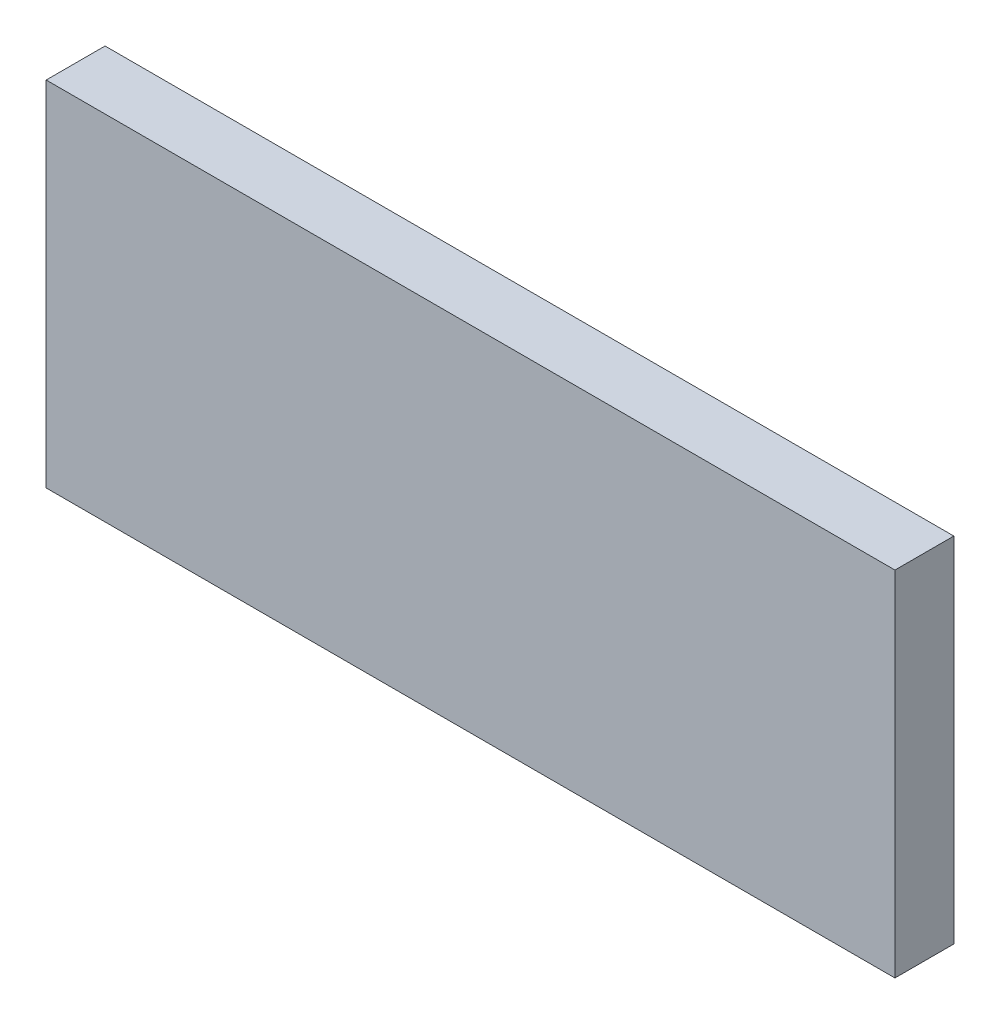
ISO-10303-21;
HEADER;
FILE_DESCRIPTION(('STEP AP214'),'2;1');
FILE_NAME('part.step','',(''),(''),'','','');
FILE_SCHEMA(('AUTOMOTIVE_DESIGN { 1 0 10303 214 1 1 1 1 }'));
ENDSEC;
DATA;
#1=APPLICATION_CONTEXT('core data for automotive mechanical design processes');
#2=APPLICATION_PROTOCOL_DEFINITION('international standard','automotive_design',2000,#1);
#3=PRODUCT_CONTEXT('',#1,'mechanical');
#4=PRODUCT('Part','Part','',(#3));
#5=PRODUCT_RELATED_PRODUCT_CATEGORY('part','',(#4));
#6=PRODUCT_DEFINITION_FORMATION('','',#4);
#7=PRODUCT_DEFINITION_CONTEXT('part definition',#1,'design');
#8=PRODUCT_DEFINITION('design','',#6,#7);
#9=PRODUCT_DEFINITION_SHAPE('','',#8);
#10=(LENGTH_UNIT() NAMED_UNIT(*) SI_UNIT(.MILLI.,.METRE.));
#11=(NAMED_UNIT(*) PLANE_ANGLE_UNIT() SI_UNIT($,.RADIAN.));
#12=(NAMED_UNIT(*) SI_UNIT($,.STERADIAN.) SOLID_ANGLE_UNIT());
#13=UNCERTAINTY_MEASURE_WITH_UNIT(LENGTH_MEASURE(1.E-05),#10,'distance_accuracy_value','');
#14=(GEOMETRIC_REPRESENTATION_CONTEXT(3) GLOBAL_UNCERTAINTY_ASSIGNED_CONTEXT((#13)) GLOBAL_UNIT_ASSIGNED_CONTEXT((#10,
#11,#12)) REPRESENTATION_CONTEXT('',''));
#15=CARTESIAN_POINT('',(0.,0.,0.));
#16=DIRECTION('',(0.,0.,1.));
#17=DIRECTION('',(1.,0.,0.));
#18=AXIS2_PLACEMENT_3D('',#15,#16,#17);
#19=CARTESIAN_POINT('',(36.035,30.,2.5));
#20=DIRECTION('',(-1.,0.,0.));
#21=DIRECTION('',(0.,0.,1.));
#22=AXIS2_PLACEMENT_3D('',#19,#20,#21);
#23=PLANE('',#22);
#24=DIRECTION('',(0.,0.,-1.));
#25=VECTOR('',#24,1.);
#26=CARTESIAN_POINT('',(36.035,0.,2.5));
#27=LINE('',#26,#25);
#28=CARTESIAN_POINT('',(36.035,0.,2.5));
#29=VERTEX_POINT('',#28);
#30=CARTESIAN_POINT('',(36.035,0.,-2.5));
#31=VERTEX_POINT('',#30);
#32=EDGE_CURVE('E214',#29,#31,#27,.T.);
#33=ORIENTED_EDGE('',*,*,#32,.T.);
#34=DIRECTION('',(0.,-1.,0.));
#35=VECTOR('',#34,1.);
#36=CARTESIAN_POINT('',(36.035,30.,-2.5));
#37=LINE('',#36,#35);
#38=CARTESIAN_POINT('',(36.035,30.,-2.5));
#39=VERTEX_POINT('',#38);
#40=EDGE_CURVE('E11',#39,#31,#37,.T.);
#41=ORIENTED_EDGE('',*,*,#40,.F.);
#42=DIRECTION('',(0.,0.,-1.));
#43=VECTOR('',#42,1.);
#44=CARTESIAN_POINT('',(36.035,30.,2.5));
#45=LINE('',#44,#43);
#46=CARTESIAN_POINT('',(36.035,30.,2.5));
#47=VERTEX_POINT('',#46);
#48=EDGE_CURVE('E229',#47,#39,#45,.T.);
#49=ORIENTED_EDGE('',*,*,#48,.F.);
#50=DIRECTION('',(0.,-1.,0.));
#51=VECTOR('',#50,1.);
#52=CARTESIAN_POINT('',(36.035,30.,2.5));
#53=LINE('',#52,#51);
#54=EDGE_CURVE('E239',#47,#29,#53,.T.);
#55=ORIENTED_EDGE('',*,*,#54,.T.);
#56=EDGE_LOOP('',(#33,#41,#49,#55));
#57=FACE_BOUND('',#56,.T.);
#58=ADVANCED_FACE('F35',(#57),#23,.F.);
#59=CARTESIAN_POINT('',(-36.035,30.,-2.5));
#60=DIRECTION('',(0.,0.,1.));
#61=DIRECTION('',(1.,0.,0.));
#62=AXIS2_PLACEMENT_3D('',#59,#60,#61);
#63=PLANE('',#62);
#64=DIRECTION('',(0.,1.,0.));
#65=VECTOR('',#64,1.);
#66=CARTESIAN_POINT('',(27.2450653599425,4.75,-2.5));
#67=LINE('',#66,#65);
#68=CARTESIAN_POINT('',(27.2450653599425,4.75,-2.5));
#69=VERTEX_POINT('',#68);
#70=CARTESIAN_POINT('',(27.2450653599425,25.25,-2.5));
#71=VERTEX_POINT('',#70);
#72=EDGE_CURVE('E147',#69,#71,#67,.T.);
#73=ORIENTED_EDGE('',*,*,#72,.F.);
#74=DIRECTION('',(-1.,0.,0.));
#75=VECTOR('',#74,1.);
#76=CARTESIAN_POINT('',(27.2450653599425,4.75,-2.5));
#77=LINE('',#76,#75);
#78=CARTESIAN_POINT('',(33.3649782133525,4.75,-2.5));
#79=VERTEX_POINT('',#78);
#80=EDGE_CURVE('E154',#79,#69,#77,.T.);
#81=ORIENTED_EDGE('',*,*,#80,.F.);
#82=DIRECTION('',(0.,1.,0.));
#83=VECTOR('',#82,1.);
#84=CARTESIAN_POINT('',(33.3649782133525,4.75,-2.5));
#85=LINE('',#84,#83);
#86=CARTESIAN_POINT('',(33.3649782133525,25.25,-2.5));
#87=VERTEX_POINT('',#86);
#88=EDGE_CURVE('E166',#79,#87,#85,.T.);
#89=ORIENTED_EDGE('',*,*,#88,.T.);
#90=DIRECTION('',(-1.,0.,0.));
#91=VECTOR('',#90,1.);
#92=CARTESIAN_POINT('',(27.2450653599425,25.25,-2.5));
#93=LINE('',#92,#91);
#94=EDGE_CURVE('E164',#87,#71,#93,.T.);
#95=ORIENTED_EDGE('',*,*,#94,.T.);
#96=EDGE_LOOP('',(#73,#81,#89,#95));
#97=FACE_BOUND('',#96,.T.);
#98=DIRECTION('',(0.,1.,0.));
#99=VECTOR('',#98,1.);
#100=CARTESIAN_POINT('',(-31.035,20.25,-2.5));
#101=LINE('',#100,#99);
#102=CARTESIAN_POINT('',(-31.035,19.,-2.5));
#103=VERTEX_POINT('',#102);
#104=CARTESIAN_POINT('',(-31.035,20.25,-2.5));
#105=VERTEX_POINT('',#104);
#106=EDGE_CURVE('E196',#103,#105,#101,.T.);
#107=ORIENTED_EDGE('',*,*,#106,.F.);
#108=DIRECTION('',(1.,0.,0.));
#109=VECTOR('',#108,1.);
#110=CARTESIAN_POINT('',(-31.035,19.,-2.5));
#111=LINE('',#110,#109);
#112=CARTESIAN_POINT('',(-36.035,19.,-2.5));
#113=VERTEX_POINT('',#112);
#114=EDGE_CURVE('E193',#113,#103,#111,.T.);
#115=ORIENTED_EDGE('',*,*,#114,.F.);
#116=DIRECTION('',(0.,-1.,0.));
#117=VECTOR('',#116,1.);
#118=CARTESIAN_POINT('',(-36.035,30.,-2.5));
#119=LINE('',#118,#117);
#120=CARTESIAN_POINT('',(-36.035,30.,-2.5));
#121=VERTEX_POINT('',#120);
#122=EDGE_CURVE('E42',#121,#113,#119,.T.);
#123=ORIENTED_EDGE('',*,*,#122,.F.);
#124=DIRECTION('',(-1.,0.,0.));
#125=VECTOR('',#124,1.);
#126=CARTESIAN_POINT('',(-36.035,30.,-2.5));
#127=LINE('',#126,#125);
#128=EDGE_CURVE('E232',#39,#121,#127,.T.);
#129=ORIENTED_EDGE('',*,*,#128,.F.);
#130=ORIENTED_EDGE('',*,*,#40,.T.);
#131=DIRECTION('',(-1.,0.,0.));
#132=VECTOR('',#131,1.);
#133=CARTESIAN_POINT('',(-36.035,0.,-2.5));
#134=LINE('',#133,#132);
#135=CARTESIAN_POINT('',(-36.035,0.,-2.5));
#136=VERTEX_POINT('',#135);
#137=EDGE_CURVE('E242',#31,#136,#134,.T.);
#138=ORIENTED_EDGE('',*,*,#137,.T.);
#139=CARTESIAN_POINT('',(-36.035,11.,-2.5));
#140=VERTEX_POINT('',#139);
#141=EDGE_CURVE('E252',#140,#136,#119,.T.);
#142=ORIENTED_EDGE('',*,*,#141,.F.);
#143=DIRECTION('',(-1.,0.,0.));
#144=VECTOR('',#143,1.);
#145=CARTESIAN_POINT('',(-36.035,11.,-2.5));
#146=LINE('',#145,#144);
#147=CARTESIAN_POINT('',(-31.035,11.,-2.5));
#148=VERTEX_POINT('',#147);
#149=EDGE_CURVE('E175',#148,#140,#146,.T.);
#150=ORIENTED_EDGE('',*,*,#149,.F.);
#151=DIRECTION('',(0.,1.,0.));
#152=VECTOR('',#151,1.);
#153=CARTESIAN_POINT('',(-31.035,11.,-2.5));
#154=LINE('',#153,#152);
#155=CARTESIAN_POINT('',(-31.035,9.75,-2.5));
#156=VERTEX_POINT('',#155);
#157=EDGE_CURVE('E208',#156,#148,#154,.T.);
#158=ORIENTED_EDGE('',*,*,#157,.F.);
#159=DIRECTION('',(-1.,0.,0.));
#160=VECTOR('',#159,1.);
#161=CARTESIAN_POINT('',(-31.035,9.75,-2.5));
#162=LINE('',#161,#160);
#163=CARTESIAN_POINT('',(1.465,9.75,-2.5));
#164=VERTEX_POINT('',#163);
#165=EDGE_CURVE('E205',#164,#156,#162,.T.);
#166=ORIENTED_EDGE('',*,*,#165,.F.);
#167=DIRECTION('',(0.,-1.,0.));
#168=VECTOR('',#167,1.);
#169=CARTESIAN_POINT('',(1.465,9.75,-2.5));
#170=LINE('',#169,#168);
#171=CARTESIAN_POINT('',(1.465,20.25,-2.5));
#172=VERTEX_POINT('',#171);
#173=EDGE_CURVE('E202',#172,#164,#170,.T.);
#174=ORIENTED_EDGE('',*,*,#173,.F.);
#175=DIRECTION('',(1.,0.,0.));
#176=VECTOR('',#175,1.);
#177=CARTESIAN_POINT('',(1.465,20.25,-2.5));
#178=LINE('',#177,#176);
#179=EDGE_CURVE('E199',#105,#172,#178,.T.);
#180=ORIENTED_EDGE('',*,*,#179,.F.);
#181=EDGE_LOOP('',(#107,#115,#123,#129,#130,#138,#142,#150,#158,#166,#174,#180));
#182=FACE_BOUND('',#181,.T.);
#183=ADVANCED_FACE('F162',(#97,#182),#63,.F.);
#184=CARTESIAN_POINT('',(-36.035,30.,2.5));
#185=DIRECTION('',(1.,0.,0.));
#186=DIRECTION('',(0.,0.,-1.));
#187=AXIS2_PLACEMENT_3D('',#184,#185,#186);
#188=PLANE('',#187);
#189=ORIENTED_EDGE('',*,*,#122,.T.);
#190=DIRECTION('',(0.,0.,-1.));
#191=VECTOR('',#190,1.);
#192=CARTESIAN_POINT('',(-36.035,19.,1.5));
#193=LINE('',#192,#191);
#194=CARTESIAN_POINT('',(-36.035,19.,1.5));
#195=VERTEX_POINT('',#194);
#196=EDGE_CURVE('E212',#195,#113,#193,.T.);
#197=ORIENTED_EDGE('',*,*,#196,.F.);
#198=DIRECTION('',(0.,1.,0.));
#199=VECTOR('',#198,1.);
#200=CARTESIAN_POINT('',(-36.035,19.,1.5));
#201=LINE('',#200,#199);
#202=CARTESIAN_POINT('',(-36.035,11.,1.5));
#203=VERTEX_POINT('',#202);
#204=EDGE_CURVE('E190',#203,#195,#201,.T.);
#205=ORIENTED_EDGE('',*,*,#204,.F.);
#206=DIRECTION('',(0.,0.,-1.));
#207=VECTOR('',#206,1.);
#208=CARTESIAN_POINT('',(-36.035,11.,1.5));
#209=LINE('',#208,#207);
#210=EDGE_CURVE('E215',#203,#140,#209,.T.);
#211=ORIENTED_EDGE('',*,*,#210,.T.);
#212=ORIENTED_EDGE('',*,*,#141,.T.);
#213=DIRECTION('',(0.,0.,1.));
#214=VECTOR('',#213,1.);
#215=CARTESIAN_POINT('',(-36.035,0.,2.5));
#216=LINE('',#215,#214);
#217=CARTESIAN_POINT('',(-36.035,0.,2.5));
#218=VERTEX_POINT('',#217);
#219=EDGE_CURVE('E245',#136,#218,#216,.T.);
#220=ORIENTED_EDGE('',*,*,#219,.T.);
#221=DIRECTION('',(0.,-1.,0.));
#222=VECTOR('',#221,1.);
#223=CARTESIAN_POINT('',(-36.035,30.,2.5));
#224=LINE('',#223,#222);
#225=CARTESIAN_POINT('',(-36.035,30.,2.5));
#226=VERTEX_POINT('',#225);
#227=EDGE_CURVE('E250',#226,#218,#224,.T.);
#228=ORIENTED_EDGE('',*,*,#227,.F.);
#229=DIRECTION('',(0.,0.,1.));
#230=VECTOR('',#229,1.);
#231=CARTESIAN_POINT('',(-36.035,30.,2.5));
#232=LINE('',#231,#230);
#233=EDGE_CURVE('E235',#121,#226,#232,.T.);
#234=ORIENTED_EDGE('',*,*,#233,.F.);
#235=EDGE_LOOP('',(#189,#197,#205,#211,#212,#220,#228,#234));
#236=FACE_BOUND('',#235,.T.);
#237=ADVANCED_FACE('F259',(#236),#188,.F.);
#238=CARTESIAN_POINT('',(-36.035,30.,2.5));
#239=DIRECTION('',(0.,0.,-1.));
#240=DIRECTION('',(-1.,0.,0.));
#241=AXIS2_PLACEMENT_3D('',#238,#239,#240);
#242=PLANE('',#241);
#243=DIRECTION('',(1.,0.,0.));
#244=VECTOR('',#243,1.);
#245=CARTESIAN_POINT('',(-36.035,0.,2.5));
#246=LINE('',#245,#244);
#247=EDGE_CURVE('E233',#218,#29,#246,.T.);
#248=ORIENTED_EDGE('',*,*,#247,.T.);
#249=ORIENTED_EDGE('',*,*,#54,.F.);
#250=DIRECTION('',(1.,0.,0.));
#251=VECTOR('',#250,1.);
#252=CARTESIAN_POINT('',(-36.035,30.,2.5));
#253=LINE('',#252,#251);
#254=EDGE_CURVE('E237',#226,#47,#253,.T.);
#255=ORIENTED_EDGE('',*,*,#254,.F.);
#256=ORIENTED_EDGE('',*,*,#227,.T.);
#257=EDGE_LOOP('',(#248,#249,#255,#256));
#258=FACE_BOUND('',#257,.T.);
#259=ADVANCED_FACE('F272',(#258),#242,.F.);
#260=CARTESIAN_POINT('',(0.,30.,0.));
#261=DIRECTION('',(0.,-1.,0.));
#262=DIRECTION('',(0.,0.,-1.));
#263=AXIS2_PLACEMENT_3D('',#260,#261,#262);
#264=PLANE('',#263);
#265=ORIENTED_EDGE('',*,*,#48,.T.);
#266=ORIENTED_EDGE('',*,*,#128,.T.);
#267=ORIENTED_EDGE('',*,*,#233,.T.);
#268=ORIENTED_EDGE('',*,*,#254,.T.);
#269=EDGE_LOOP('',(#265,#266,#267,#268));
#270=FACE_BOUND('',#269,.T.);
#271=ADVANCED_FACE('F277',(#270),#264,.F.);
#272=CARTESIAN_POINT('',(0.,0.,0.));
#273=DIRECTION('',(0.,-1.,0.));
#274=DIRECTION('',(0.,0.,-1.));
#275=AXIS2_PLACEMENT_3D('',#272,#273,#274);
#276=PLANE('',#275);
#277=ORIENTED_EDGE('',*,*,#32,.F.);
#278=ORIENTED_EDGE('',*,*,#247,.F.);
#279=ORIENTED_EDGE('',*,*,#219,.F.);
#280=ORIENTED_EDGE('',*,*,#137,.F.);
#281=EDGE_LOOP('',(#277,#278,#279,#280));
#282=FACE_BOUND('',#281,.T.);
#283=ADVANCED_FACE('F269',(#282),#276,.T.);
#284=CARTESIAN_POINT('',(-31.035,19.,1.5));
#285=DIRECTION('',(0.,1.,0.));
#286=DIRECTION('',(0.,0.,1.));
#287=AXIS2_PLACEMENT_3D('',#284,#285,#286);
#288=PLANE('',#287);
#289=ORIENTED_EDGE('',*,*,#114,.T.);
#290=DIRECTION('',(0.,0.,-1.));
#291=VECTOR('',#290,1.);
#292=CARTESIAN_POINT('',(-31.035,19.,1.5));
#293=LINE('',#292,#291);
#294=CARTESIAN_POINT('',(-31.035,19.,1.5));
#295=VERTEX_POINT('',#294);
#296=EDGE_CURVE('E192',#295,#103,#293,.T.);
#297=ORIENTED_EDGE('',*,*,#296,.F.);
#298=DIRECTION('',(1.,0.,0.));
#299=VECTOR('',#298,1.);
#300=CARTESIAN_POINT('',(-31.035,19.,1.5));
#301=LINE('',#300,#299);
#302=EDGE_CURVE('E171',#195,#295,#301,.T.);
#303=ORIENTED_EDGE('',*,*,#302,.F.);
#304=ORIENTED_EDGE('',*,*,#196,.T.);
#305=EDGE_LOOP('',(#289,#297,#303,#304));
#306=FACE_BOUND('',#305,.T.);
#307=ADVANCED_FACE('F281',(#306),#288,.F.);
#308=CARTESIAN_POINT('',(-36.035,11.,1.5));
#309=DIRECTION('',(0.,-1.,0.));
#310=DIRECTION('',(0.,0.,-1.));
#311=AXIS2_PLACEMENT_3D('',#308,#309,#310);
#312=PLANE('',#311);
#313=ORIENTED_EDGE('',*,*,#149,.T.);
#314=ORIENTED_EDGE('',*,*,#210,.F.);
#315=DIRECTION('',(-1.,0.,0.));
#316=VECTOR('',#315,1.);
#317=CARTESIAN_POINT('',(-36.035,11.,1.5));
#318=LINE('',#317,#316);
#319=CARTESIAN_POINT('',(-31.035,11.,1.5));
#320=VERTEX_POINT('',#319);
#321=EDGE_CURVE('E57',#320,#203,#318,.T.);
#322=ORIENTED_EDGE('',*,*,#321,.F.);
#323=DIRECTION('',(0.,0.,-1.));
#324=VECTOR('',#323,1.);
#325=CARTESIAN_POINT('',(-31.035,11.,1.5));
#326=LINE('',#325,#324);
#327=EDGE_CURVE('E218',#320,#148,#326,.T.);
#328=ORIENTED_EDGE('',*,*,#327,.T.);
#329=EDGE_LOOP('',(#313,#314,#322,#328));
#330=FACE_BOUND('',#329,.T.);
#331=ADVANCED_FACE('F302',(#330),#312,.F.);
#332=CARTESIAN_POINT('',(-31.035,11.,1.5));
#333=DIRECTION('',(-1.,0.,0.));
#334=DIRECTION('',(0.,0.,1.));
#335=AXIS2_PLACEMENT_3D('',#332,#333,#334);
#336=PLANE('',#335);
#337=ORIENTED_EDGE('',*,*,#157,.T.);
#338=ORIENTED_EDGE('',*,*,#327,.F.);
#339=DIRECTION('',(0.,1.,0.));
#340=VECTOR('',#339,1.);
#341=CARTESIAN_POINT('',(-31.035,11.,1.5));
#342=LINE('',#341,#340);
#343=CARTESIAN_POINT('',(-31.035,9.75,1.5));
#344=VERTEX_POINT('',#343);
#345=EDGE_CURVE('E187',#344,#320,#342,.T.);
#346=ORIENTED_EDGE('',*,*,#345,.F.);
#347=DIRECTION('',(0.,0.,-1.));
#348=VECTOR('',#347,1.);
#349=CARTESIAN_POINT('',(-31.035,9.75,1.5));
#350=LINE('',#349,#348);
#351=EDGE_CURVE('E220',#344,#156,#350,.T.);
#352=ORIENTED_EDGE('',*,*,#351,.T.);
#353=EDGE_LOOP('',(#337,#338,#346,#352));
#354=FACE_BOUND('',#353,.T.);
#355=ADVANCED_FACE('F300',(#354),#336,.F.);
#356=CARTESIAN_POINT('',(-31.035,9.75,1.5));
#357=DIRECTION('',(0.,-1.,0.));
#358=DIRECTION('',(0.,0.,-1.));
#359=AXIS2_PLACEMENT_3D('',#356,#357,#358);
#360=PLANE('',#359);
#361=ORIENTED_EDGE('',*,*,#165,.T.);
#362=ORIENTED_EDGE('',*,*,#351,.F.);
#363=DIRECTION('',(-1.,0.,0.));
#364=VECTOR('',#363,1.);
#365=CARTESIAN_POINT('',(-31.035,9.75,1.5));
#366=LINE('',#365,#364);
#367=CARTESIAN_POINT('',(1.465,9.75,1.5));
#368=VERTEX_POINT('',#367);
#369=EDGE_CURVE('E184',#368,#344,#366,.T.);
#370=ORIENTED_EDGE('',*,*,#369,.F.);
#371=DIRECTION('',(0.,0.,-1.));
#372=VECTOR('',#371,1.);
#373=CARTESIAN_POINT('',(1.465,9.75,1.5));
#374=LINE('',#373,#372);
#375=EDGE_CURVE('E222',#368,#164,#374,.T.);
#376=ORIENTED_EDGE('',*,*,#375,.T.);
#377=EDGE_LOOP('',(#361,#362,#370,#376));
#378=FACE_BOUND('',#377,.T.);
#379=ADVANCED_FACE('F296',(#378),#360,.F.);
#380=CARTESIAN_POINT('',(1.465,9.75,1.5));
#381=DIRECTION('',(1.,0.,0.));
#382=DIRECTION('',(0.,0.,-1.));
#383=AXIS2_PLACEMENT_3D('',#380,#381,#382);
#384=PLANE('',#383);
#385=ORIENTED_EDGE('',*,*,#173,.T.);
#386=ORIENTED_EDGE('',*,*,#375,.F.);
#387=DIRECTION('',(0.,-1.,0.));
#388=VECTOR('',#387,1.);
#389=CARTESIAN_POINT('',(1.465,9.75,1.5));
#390=LINE('',#389,#388);
#391=CARTESIAN_POINT('',(1.465,20.25,1.5));
#392=VERTEX_POINT('',#391);
#393=EDGE_CURVE('E181',#392,#368,#390,.T.);
#394=ORIENTED_EDGE('',*,*,#393,.F.);
#395=DIRECTION('',(0.,0.,-1.));
#396=VECTOR('',#395,1.);
#397=CARTESIAN_POINT('',(1.465,20.25,1.5));
#398=LINE('',#397,#396);
#399=EDGE_CURVE('E224',#392,#172,#398,.T.);
#400=ORIENTED_EDGE('',*,*,#399,.T.);
#401=EDGE_LOOP('',(#385,#386,#394,#400));
#402=FACE_BOUND('',#401,.T.);
#403=ADVANCED_FACE('F292',(#402),#384,.F.);
#404=CARTESIAN_POINT('',(1.465,20.25,1.5));
#405=DIRECTION('',(0.,1.,0.));
#406=DIRECTION('',(0.,0.,1.));
#407=AXIS2_PLACEMENT_3D('',#404,#405,#406);
#408=PLANE('',#407);
#409=ORIENTED_EDGE('',*,*,#179,.T.);
#410=ORIENTED_EDGE('',*,*,#399,.F.);
#411=DIRECTION('',(1.,0.,0.));
#412=VECTOR('',#411,1.);
#413=CARTESIAN_POINT('',(1.465,20.25,1.5));
#414=LINE('',#413,#412);
#415=CARTESIAN_POINT('',(-31.035,20.25,1.5));
#416=VERTEX_POINT('',#415);
#417=EDGE_CURVE('E178',#416,#392,#414,.T.);
#418=ORIENTED_EDGE('',*,*,#417,.F.);
#419=DIRECTION('',(0.,0.,-1.));
#420=VECTOR('',#419,1.);
#421=CARTESIAN_POINT('',(-31.035,20.25,1.5));
#422=LINE('',#421,#420);
#423=EDGE_CURVE('E226',#416,#105,#422,.T.);
#424=ORIENTED_EDGE('',*,*,#423,.T.);
#425=EDGE_LOOP('',(#409,#410,#418,#424));
#426=FACE_BOUND('',#425,.T.);
#427=ADVANCED_FACE('F288',(#426),#408,.F.);
#428=CARTESIAN_POINT('',(-31.035,20.25,1.5));
#429=DIRECTION('',(-1.,0.,0.));
#430=DIRECTION('',(0.,0.,1.));
#431=AXIS2_PLACEMENT_3D('',#428,#429,#430);
#432=PLANE('',#431);
#433=ORIENTED_EDGE('',*,*,#106,.T.);
#434=ORIENTED_EDGE('',*,*,#423,.F.);
#435=DIRECTION('',(0.,1.,0.));
#436=VECTOR('',#435,1.);
#437=CARTESIAN_POINT('',(-31.035,20.25,1.5));
#438=LINE('',#437,#436);
#439=EDGE_CURVE('E174',#295,#416,#438,.T.);
#440=ORIENTED_EDGE('',*,*,#439,.F.);
#441=ORIENTED_EDGE('',*,*,#296,.T.);
#442=EDGE_LOOP('',(#433,#434,#440,#441));
#443=FACE_BOUND('',#442,.T.);
#444=ADVANCED_FACE('F286',(#443),#432,.F.);
#445=CARTESIAN_POINT('',(0.,0.,1.5));
#446=DIRECTION('',(0.,0.,1.));
#447=DIRECTION('',(1.,0.,0.));
#448=AXIS2_PLACEMENT_3D('',#445,#446,#447);
#449=PLANE('',#448);
#450=ORIENTED_EDGE('',*,*,#302,.T.);
#451=ORIENTED_EDGE('',*,*,#439,.T.);
#452=ORIENTED_EDGE('',*,*,#417,.T.);
#453=ORIENTED_EDGE('',*,*,#393,.T.);
#454=ORIENTED_EDGE('',*,*,#369,.T.);
#455=ORIENTED_EDGE('',*,*,#345,.T.);
#456=ORIENTED_EDGE('',*,*,#321,.T.);
#457=ORIENTED_EDGE('',*,*,#204,.T.);
#458=EDGE_LOOP('',(#450,#451,#452,#453,#454,#455,#456,#457));
#459=FACE_BOUND('',#458,.T.);
#460=ADVANCED_FACE('F283',(#459),#449,.F.);
#461=CARTESIAN_POINT('',(33.3649782133525,4.75,-2.5));
#462=DIRECTION('',(0.866025403784439,0.,0.499999999999999));
#463=DIRECTION('',(0.499999999999999,0.,-0.866025403784439));
#464=AXIS2_PLACEMENT_3D('',#461,#462,#463);
#465=PLANE('',#464);
#466=DIRECTION('',(0.499999999999999,0.,-0.866025403784439));
#467=VECTOR('',#466,1.);
#468=CARTESIAN_POINT('',(33.3649782133525,25.25,-2.5));
#469=LINE('',#468,#467);
#470=CARTESIAN_POINT('',(31.835,25.25,0.15));
#471=VERTEX_POINT('',#470);
#472=EDGE_CURVE('E160',#471,#87,#469,.T.);
#473=ORIENTED_EDGE('',*,*,#472,.T.);
#474=ORIENTED_EDGE('',*,*,#88,.F.);
#475=DIRECTION('',(0.499999999999999,0.,-0.866025403784439));
#476=VECTOR('',#475,1.);
#477=CARTESIAN_POINT('',(33.3649782133525,4.75,-2.5));
#478=LINE('',#477,#476);
#479=CARTESIAN_POINT('',(31.835,4.75,0.15));
#480=VERTEX_POINT('',#479);
#481=EDGE_CURVE('E153',#480,#79,#478,.T.);
#482=ORIENTED_EDGE('',*,*,#481,.F.);
#483=DIRECTION('',(0.,1.,0.));
#484=VECTOR('',#483,1.);
#485=CARTESIAN_POINT('',(31.835,4.75,0.15));
#486=LINE('',#485,#484);
#487=EDGE_CURVE('E149',#480,#471,#486,.T.);
#488=ORIENTED_EDGE('',*,*,#487,.T.);
#489=EDGE_LOOP('',(#473,#474,#482,#488));
#490=FACE_BOUND('',#489,.T.);
#491=ADVANCED_FACE('F356',(#490),#465,.F.);
#492=CARTESIAN_POINT('',(31.835,4.75,0.15));
#493=DIRECTION('',(-0.500000000000001,0.,0.866025403784438));
#494=DIRECTION('',(0.866025403784438,0.,0.500000000000001));
#495=AXIS2_PLACEMENT_3D('',#492,#493,#494);
#496=PLANE('',#495);
#497=DIRECTION('',(0.866025403784438,0.,0.500000000000001));
#498=VECTOR('',#497,1.);
#499=CARTESIAN_POINT('',(31.835,25.25,0.15));
#500=LINE('',#499,#498);
#501=EDGE_CURVE('E49',#71,#471,#500,.T.);
#502=ORIENTED_EDGE('',*,*,#501,.T.);
#503=ORIENTED_EDGE('',*,*,#487,.F.);
#504=DIRECTION('',(0.866025403784438,0.,0.500000000000001));
#505=VECTOR('',#504,1.);
#506=CARTESIAN_POINT('',(31.835,4.75,0.15));
#507=LINE('',#506,#505);
#508=EDGE_CURVE('E143',#69,#480,#507,.T.);
#509=ORIENTED_EDGE('',*,*,#508,.F.);
#510=ORIENTED_EDGE('',*,*,#72,.T.);
#511=EDGE_LOOP('',(#502,#503,#509,#510));
#512=FACE_BOUND('',#511,.T.);
#513=ADVANCED_FACE('F145',(#512),#496,.F.);
#514=CARTESIAN_POINT('',(0.,4.75,0.));
#515=DIRECTION('',(0.,-1.,0.));
#516=DIRECTION('',(0.,0.,-1.));
#517=AXIS2_PLACEMENT_3D('',#514,#515,#516);
#518=PLANE('',#517);
#519=ORIENTED_EDGE('',*,*,#80,.T.);
#520=ORIENTED_EDGE('',*,*,#508,.T.);
#521=ORIENTED_EDGE('',*,*,#481,.T.);
#522=EDGE_LOOP('',(#519,#520,#521));
#523=FACE_BOUND('',#522,.T.);
#524=ADVANCED_FACE('F157',(#523),#518,.F.);
#525=CARTESIAN_POINT('',(0.,25.25,0.));
#526=DIRECTION('',(0.,-1.,0.));
#527=DIRECTION('',(0.,0.,-1.));
#528=AXIS2_PLACEMENT_3D('',#525,#526,#527);
#529=PLANE('',#528);
#530=ORIENTED_EDGE('',*,*,#94,.F.);
#531=ORIENTED_EDGE('',*,*,#472,.F.);
#532=ORIENTED_EDGE('',*,*,#501,.F.);
#533=EDGE_LOOP('',(#530,#531,#532));
#534=FACE_BOUND('',#533,.T.);
#535=ADVANCED_FACE('F375',(#534),#529,.T.);
#536=CLOSED_SHELL('',(#58,#183,#237,#259,#271,#283,#307,#331,#355,#379,#403,#427,#444,#460,#491,
#513,#524,#535));
#537=MANIFOLD_SOLID_BREP('B2',#536);
#538=ADVANCED_BREP_SHAPE_REPRESENTATION('',(#18,#537),#14);
#539=SHAPE_DEFINITION_REPRESENTATION(#9,#538);
ENDSEC;
END-ISO-10303-21;
